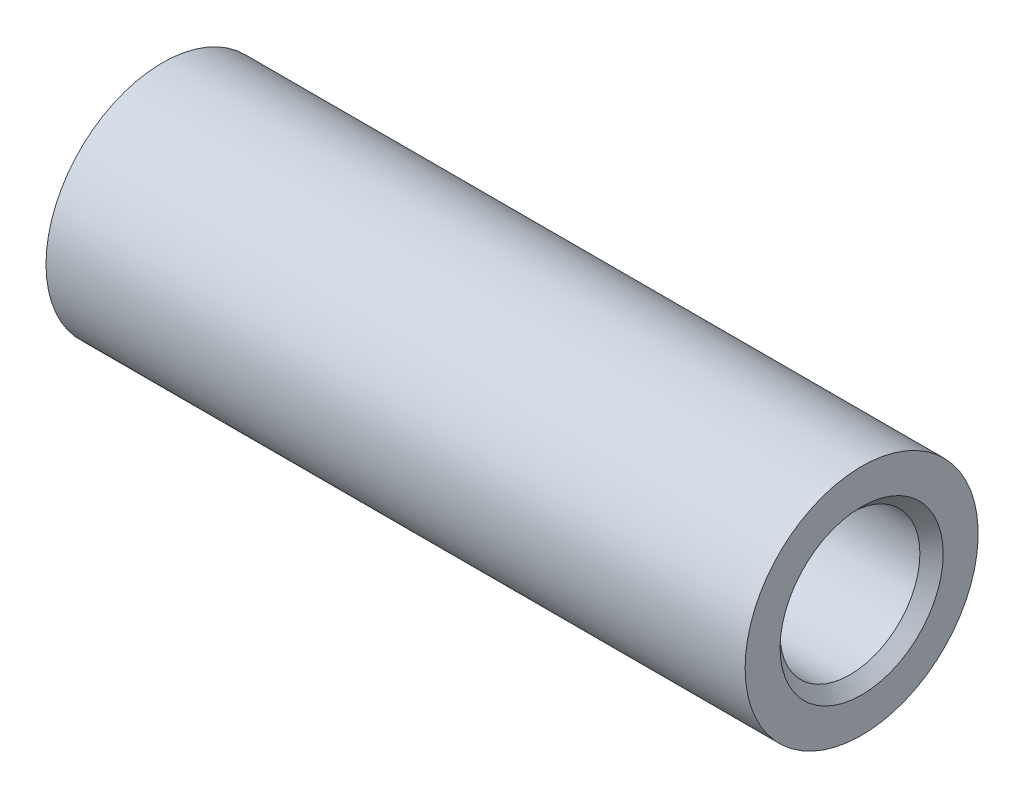
ISO-10303-21;
HEADER;
FILE_DESCRIPTION(('STEP AP214'),'2;1');
FILE_NAME('part.step','',(''),(''),'','','');
FILE_SCHEMA(('AUTOMOTIVE_DESIGN { 1 0 10303 214 1 1 1 1 }'));
ENDSEC;
DATA;
#1=APPLICATION_CONTEXT('core data for automotive mechanical design processes');
#2=APPLICATION_PROTOCOL_DEFINITION('international standard','automotive_design',2000,#1);
#3=PRODUCT_CONTEXT('',#1,'mechanical');
#4=PRODUCT('Part','Part','',(#3));
#5=PRODUCT_RELATED_PRODUCT_CATEGORY('part','',(#4));
#6=PRODUCT_DEFINITION_FORMATION('','',#4);
#7=PRODUCT_DEFINITION_CONTEXT('part definition',#1,'design');
#8=PRODUCT_DEFINITION('design','',#6,#7);
#9=PRODUCT_DEFINITION_SHAPE('','',#8);
#10=(LENGTH_UNIT() NAMED_UNIT(*) SI_UNIT(.MILLI.,.METRE.));
#11=(NAMED_UNIT(*) PLANE_ANGLE_UNIT() SI_UNIT($,.RADIAN.));
#12=(NAMED_UNIT(*) SI_UNIT($,.STERADIAN.) SOLID_ANGLE_UNIT());
#13=UNCERTAINTY_MEASURE_WITH_UNIT(LENGTH_MEASURE(1.E-05),#10,'distance_accuracy_value','');
#14=(GEOMETRIC_REPRESENTATION_CONTEXT(3) GLOBAL_UNCERTAINTY_ASSIGNED_CONTEXT((#13)) GLOBAL_UNIT_ASSIGNED_CONTEXT((#10,
#11,#12)) REPRESENTATION_CONTEXT('',''));
#15=CARTESIAN_POINT('',(0.,0.,0.));
#16=DIRECTION('',(0.,0.,1.));
#17=DIRECTION('',(1.,0.,0.));
#18=AXIS2_PLACEMENT_3D('',#15,#16,#17);
#19=CARTESIAN_POINT('',(291.421356237309,0.,0.));
#20=DIRECTION('',(-0.999999999999998,0.,0.));
#21=DIRECTION('',(0.,0.,1.));
#22=AXIS2_PLACEMENT_3D('',#19,#20,#21);
#23=CYLINDRICAL_SURFACE('',#22,50.);
#24=CARTESIAN_POINT('',(-149.999999999999,0.,0.));
#25=DIRECTION('',(0.999999999999998,0.,0.));
#26=DIRECTION('',(0.,0.,-1.));
#27=AXIS2_PLACEMENT_3D('',#24,#25,#26);
#28=CIRCLE('',#27,50.);
#29=CARTESIAN_POINT('',(-149.999999999999,0.,50.));
#30=VERTEX_POINT('',#29);
#31=EDGE_CURVE('E53',#30,#30,#28,.T.);
#32=CARTESIAN_POINT('',(149.999999999999,0.,0.));
#33=DIRECTION('',(0.999999999999998,0.,0.));
#34=DIRECTION('',(0.,0.,-1.));
#35=AXIS2_PLACEMENT_3D('',#32,#33,#34);
#36=CIRCLE('',#35,50.);
#37=CARTESIAN_POINT('',(150.,0.,50.));
#38=VERTEX_POINT('',#37);
#39=EDGE_CURVE('E52',#38,#38,#36,.T.);
#40=CARTESIAN_POINT('',(-149.999999999999,0.,50.));
#41=CARTESIAN_POINT('',(-146.874999999999,0.,50.));
#42=CARTESIAN_POINT('',(-143.749999999999,0.,50.));
#43=CARTESIAN_POINT('',(-137.5,0.,50.));
#44=CARTESIAN_POINT('',(-134.375,0.,50.));
#45=CARTESIAN_POINT('',(-128.125,0.,50.));
#46=CARTESIAN_POINT('',(-125.,0.,50.));
#47=CARTESIAN_POINT('',(-118.75,0.,50.));
#48=CARTESIAN_POINT('',(-115.625,0.,50.));
#49=CARTESIAN_POINT('',(-109.375,0.,50.));
#50=CARTESIAN_POINT('',(-106.25,0.,50.));
#51=CARTESIAN_POINT('',(-99.9999999999996,0.,50.));
#52=CARTESIAN_POINT('',(-96.8749999999997,0.,50.));
#53=CARTESIAN_POINT('',(-90.6249999999997,0.,50.));
#54=CARTESIAN_POINT('',(-87.4999999999996,0.,50.));
#55=CARTESIAN_POINT('',(-81.2499999999997,0.,50.));
#56=CARTESIAN_POINT('',(-78.1249999999997,0.,50.));
#57=CARTESIAN_POINT('',(-71.8749999999997,0.,50.));
#58=CARTESIAN_POINT('',(-68.7499999999998,0.,50.));
#59=CARTESIAN_POINT('',(-62.4999999999998,0.,50.));
#60=CARTESIAN_POINT('',(-59.3749999999998,0.,50.));
#61=CARTESIAN_POINT('',(-53.1249999999998,0.,50.));
#62=CARTESIAN_POINT('',(-49.9999999999998,0.,50.));
#63=CARTESIAN_POINT('',(-43.7499999999998,0.,50.));
#64=CARTESIAN_POINT('',(-40.6249999999999,0.,50.));
#65=CARTESIAN_POINT('',(-34.3749999999999,0.,50.));
#66=CARTESIAN_POINT('',(-31.2499999999999,0.,50.));
#67=CARTESIAN_POINT('',(-24.9999999999999,0.,50.));
#68=CARTESIAN_POINT('',(-21.8749999999999,0.,50.));
#69=CARTESIAN_POINT('',(-15.6249999999999,0.,50.));
#70=CARTESIAN_POINT('',(-12.5,0.,50.));
#71=CARTESIAN_POINT('',(-6.24999999999998,0.,50.));
#72=CARTESIAN_POINT('',(-3.12499999999999,0.,50.));
#73=CARTESIAN_POINT('',(3.12500000000001,0.,50.));
#74=CARTESIAN_POINT('',(6.25000000000001,0.,50.));
#75=CARTESIAN_POINT('',(12.5,0.,50.));
#76=CARTESIAN_POINT('',(15.625,0.,50.));
#77=CARTESIAN_POINT('',(21.875,0.,50.));
#78=CARTESIAN_POINT('',(24.9999999999999,0.,50.));
#79=CARTESIAN_POINT('',(31.2499999999999,0.,50.));
#80=CARTESIAN_POINT('',(34.3749999999999,0.,50.));
#81=CARTESIAN_POINT('',(40.6249999999999,0.,50.));
#82=CARTESIAN_POINT('',(43.7499999999999,0.,50.));
#83=CARTESIAN_POINT('',(49.9999999999999,0.,50.));
#84=CARTESIAN_POINT('',(53.1249999999998,0.,50.));
#85=CARTESIAN_POINT('',(59.3749999999998,0.,50.));
#86=CARTESIAN_POINT('',(62.4999999999998,0.,50.));
#87=CARTESIAN_POINT('',(68.7499999999998,0.,50.));
#88=CARTESIAN_POINT('',(71.8749999999998,0.,50.));
#89=CARTESIAN_POINT('',(78.1249999999998,0.,50.));
#90=CARTESIAN_POINT('',(81.2499999999998,0.,50.));
#91=CARTESIAN_POINT('',(87.4999999999997,0.,50.));
#92=CARTESIAN_POINT('',(90.6249999999997,0.,50.));
#93=CARTESIAN_POINT('',(96.8749999999997,0.,50.));
#94=CARTESIAN_POINT('',(99.9999999999997,0.,50.));
#95=CARTESIAN_POINT('',(106.25,0.,50.));
#96=CARTESIAN_POINT('',(109.375,0.,50.));
#97=CARTESIAN_POINT('',(115.625,0.,50.));
#98=CARTESIAN_POINT('',(118.75,0.,50.));
#99=CARTESIAN_POINT('',(125.,0.,50.));
#100=CARTESIAN_POINT('',(128.125,0.,50.));
#101=CARTESIAN_POINT('',(134.375,0.,50.));
#102=CARTESIAN_POINT('',(137.5,0.,50.));
#103=CARTESIAN_POINT('',(143.75,0.,50.));
#104=CARTESIAN_POINT('',(146.875,0.,50.));
#105=CARTESIAN_POINT('',(150.,0.,50.));
#106=B_SPLINE_CURVE_WITH_KNOTS('',3,(#40,#41,#42,#43,#44,#45,#46,#47,#48,#49,#50,#51,#52,#53,
#54,#55,#56,#57,#58,#59,#60,#61,#62,#63,#64,#65,#66,#67,#68,#69,#70,#71,#72,#73,#74,#75,#76,#77,
#78,#79,#80,#81,#82,#83,#84,#85,#86,#87,#88,#89,#90,#91,#92,#93,#94,#95,#96,#97,#98,#99,#100,
#101,#102,#103,#104,#105),.UNSPECIFIED.,.F.,.F.,(4,2,2,2,2,2,2,2,2,2,2,2,2,2,2,2,2,2,2,2,2,2,2,
2,2,2,2,2,2,2,2,2,4),(0.,9.37499999999997,18.7499999999999,28.1249999999999,37.4999999999999,
46.8749999999998,56.2499999999998,65.6249999999998,74.9999999999997,84.3749999999997,
93.7499999999997,103.125,112.5,121.875,131.25,140.624999999999,149.999999999999,
159.374999999999,168.749999999999,178.124999999999,187.499999999999,196.874999999999,
206.249999999999,215.624999999999,224.999999999999,234.374999999999,243.749999999999,
253.124999999999,262.499999999999,271.874999999999,281.249999999999,290.624999999999,
299.999999999999),.UNSPECIFIED.);
#107=EDGE_CURVE('BSEAM32',#30,#38,#106,.T.);
#108=ORIENTED_EDGE('',*,*,#31,.T.);
#109=ORIENTED_EDGE('',*,*,#39,.F.);
#110=ORIENTED_EDGE('',*,*,#107,.T.);
#111=ORIENTED_EDGE('',*,*,#107,.F.);
#112=EDGE_LOOP('',(#108,#110,#109,#111));
#113=FACE_BOUND('',#112,.T.);
#114=ADVANCED_FACE('F32',(#113),#23,.T.);
#115=CARTESIAN_POINT('',(-149.999999999999,0.,0.));
#116=DIRECTION('',(0.999999999999998,0.,0.));
#117=DIRECTION('',(0.,0.,-1.));
#118=AXIS2_PLACEMENT_3D('',#115,#116,#117);
#119=PLANE('',#118);
#120=CARTESIAN_POINT('',(-149.999999999999,0.,0.));
#121=DIRECTION('',(0.999999999999998,0.,0.));
#122=DIRECTION('',(0.,0.,-1.));
#123=AXIS2_PLACEMENT_3D('',#120,#121,#122);
#124=CIRCLE('',#123,35.);
#125=CARTESIAN_POINT('',(-149.999999999999,0.,35.));
#126=VERTEX_POINT('',#125);
#127=EDGE_CURVE('E47',#126,#126,#124,.T.);
#128=ORIENTED_EDGE('',*,*,#127,.T.);
#129=EDGE_LOOP('',(#128));
#130=FACE_BOUND('',#129,.T.);
#131=ORIENTED_EDGE('',*,*,#31,.F.);
#132=EDGE_LOOP('',(#131));
#133=FACE_BOUND('',#132,.T.);
#134=ADVANCED_FACE('F62',(#130,#133),#119,.F.);
#135=CARTESIAN_POINT('',(291.421356237309,0.,0.));
#136=DIRECTION('',(-0.999999999999998,0.,0.));
#137=DIRECTION('',(0.,0.,1.));
#138=AXIS2_PLACEMENT_3D('',#135,#136,#137);
#139=CYLINDRICAL_SURFACE('',#138,30.);
#140=CARTESIAN_POINT('',(-145.,0.,0.));
#141=DIRECTION('',(0.999999999999998,0.,0.));
#142=DIRECTION('',(0.,0.,-1.));
#143=AXIS2_PLACEMENT_3D('',#140,#141,#142);
#144=CIRCLE('',#143,30.);
#145=CARTESIAN_POINT('',(-144.999999999999,0.,30.));
#146=VERTEX_POINT('',#145);
#147=EDGE_CURVE('E39',#146,#146,#144,.F.);
#148=CARTESIAN_POINT('',(144.999999999999,0.,0.));
#149=DIRECTION('',(0.999999999999998,0.,0.));
#150=DIRECTION('',(0.,0.,-1.));
#151=AXIS2_PLACEMENT_3D('',#148,#149,#150);
#152=CIRCLE('',#151,30.);
#153=CARTESIAN_POINT('',(144.999999999999,0.,30.));
#154=VERTEX_POINT('',#153);
#155=EDGE_CURVE('E43',#154,#154,#152,.T.);
#156=CARTESIAN_POINT('',(-144.999999999999,0.,30.));
#157=CARTESIAN_POINT('',(-141.979166666666,0.,30.));
#158=CARTESIAN_POINT('',(-138.958333333333,0.,30.));
#159=CARTESIAN_POINT('',(-132.916666666666,0.,30.));
#160=CARTESIAN_POINT('',(-129.895833333333,0.,30.));
#161=CARTESIAN_POINT('',(-123.854166666666,0.,30.));
#162=CARTESIAN_POINT('',(-120.833333333333,0.,30.));
#163=CARTESIAN_POINT('',(-114.791666666666,0.,30.));
#164=CARTESIAN_POINT('',(-111.770833333333,0.,30.));
#165=CARTESIAN_POINT('',(-105.729166666666,0.,30.));
#166=CARTESIAN_POINT('',(-102.708333333333,0.,30.));
#167=CARTESIAN_POINT('',(-96.6666666666663,0.,30.));
#168=CARTESIAN_POINT('',(-93.645833333333,0.,30.));
#169=CARTESIAN_POINT('',(-87.6041666666664,0.,30.));
#170=CARTESIAN_POINT('',(-84.583333333333,0.,30.));
#171=CARTESIAN_POINT('',(-78.5416666666664,0.,30.));
#172=CARTESIAN_POINT('',(-75.520833333333,0.,30.));
#173=CARTESIAN_POINT('',(-69.4791666666664,0.,30.));
#174=CARTESIAN_POINT('',(-66.4583333333331,0.,30.));
#175=CARTESIAN_POINT('',(-60.4166666666665,0.,30.));
#176=CARTESIAN_POINT('',(-57.3958333333331,0.,30.));
#177=CARTESIAN_POINT('',(-51.3541666666665,0.,30.));
#178=CARTESIAN_POINT('',(-48.3333333333332,0.,30.));
#179=CARTESIAN_POINT('',(-42.2916666666665,0.,30.));
#180=CARTESIAN_POINT('',(-39.2708333333332,0.,30.));
#181=CARTESIAN_POINT('',(-33.2291666666666,0.,30.));
#182=CARTESIAN_POINT('',(-30.2083333333332,0.,30.));
#183=CARTESIAN_POINT('',(-24.1666666666666,0.,30.));
#184=CARTESIAN_POINT('',(-21.1458333333333,0.,30.));
#185=CARTESIAN_POINT('',(-15.1041666666666,0.,30.));
#186=CARTESIAN_POINT('',(-12.0833333333333,0.,30.));
#187=CARTESIAN_POINT('',(-6.04166666666661,0.,30.));
#188=CARTESIAN_POINT('',(-3.02083333333331,0.,30.));
#189=CARTESIAN_POINT('',(3.02083333333332,0.,30.));
#190=CARTESIAN_POINT('',(6.04166666666665,0.,30.));
#191=CARTESIAN_POINT('',(12.0833333333333,0.,30.));
#192=CARTESIAN_POINT('',(15.1041666666666,0.,30.));
#193=CARTESIAN_POINT('',(21.1458333333333,0.,30.));
#194=CARTESIAN_POINT('',(24.1666666666666,0.,30.));
#195=CARTESIAN_POINT('',(30.2083333333332,0.,30.));
#196=CARTESIAN_POINT('',(33.2291666666665,0.,30.));
#197=CARTESIAN_POINT('',(39.2708333333332,0.,30.));
#198=CARTESIAN_POINT('',(42.2916666666665,0.,30.));
#199=CARTESIAN_POINT('',(48.3333333333332,0.,30.));
#200=CARTESIAN_POINT('',(51.3541666666665,0.,30.));
#201=CARTESIAN_POINT('',(57.3958333333331,0.,30.));
#202=CARTESIAN_POINT('',(60.4166666666664,0.,30.));
#203=CARTESIAN_POINT('',(66.4583333333331,0.,30.));
#204=CARTESIAN_POINT('',(69.4791666666664,0.,30.));
#205=CARTESIAN_POINT('',(75.520833333333,0.,30.));
#206=CARTESIAN_POINT('',(78.5416666666664,0.,30.));
#207=CARTESIAN_POINT('',(84.583333333333,0.,30.));
#208=CARTESIAN_POINT('',(87.6041666666663,0.,30.));
#209=CARTESIAN_POINT('',(93.645833333333,0.,30.));
#210=CARTESIAN_POINT('',(96.6666666666663,0.,30.));
#211=CARTESIAN_POINT('',(102.708333333333,0.,30.));
#212=CARTESIAN_POINT('',(105.729166666666,0.,30.));
#213=CARTESIAN_POINT('',(111.770833333333,0.,30.));
#214=CARTESIAN_POINT('',(114.791666666666,0.,30.));
#215=CARTESIAN_POINT('',(120.833333333333,0.,30.));
#216=CARTESIAN_POINT('',(123.854166666666,0.,30.));
#217=CARTESIAN_POINT('',(129.895833333333,0.,30.));
#218=CARTESIAN_POINT('',(132.916666666666,0.,30.));
#219=CARTESIAN_POINT('',(138.958333333333,0.,30.));
#220=CARTESIAN_POINT('',(141.979166666666,0.,30.));
#221=CARTESIAN_POINT('',(144.999999999999,0.,30.));
#222=B_SPLINE_CURVE_WITH_KNOTS('',3,(#156,#157,#158,#159,#160,#161,#162,#163,#164,#165,#166,
#167,#168,#169,#170,#171,#172,#173,#174,#175,#176,#177,#178,#179,#180,#181,#182,#183,#184,#185,
#186,#187,#188,#189,#190,#191,#192,#193,#194,#195,#196,#197,#198,#199,#200,#201,#202,#203,#204,
#205,#206,#207,#208,#209,#210,#211,#212,#213,#214,#215,#216,#217,#218,#219,#220,#221),
.UNSPECIFIED.,.F.,.F.,(4,2,2,2,2,2,2,2,2,2,2,2,2,2,2,2,2,2,2,2,2,2,2,2,2,2,2,2,2,2,2,2,4),(0.,
9.06249999999992,18.1249999999999,27.1874999999999,36.2499999999998,45.3124999999998,
54.3749999999998,63.4374999999998,72.4999999999997,81.5624999999997,90.6249999999996,
99.6874999999996,108.75,117.8125,126.875,135.9375,144.999999999999,154.062499999999,
163.124999999999,172.187499999999,181.249999999999,190.312499999999,199.374999999999,
208.437499999999,217.499999999999,226.562499999999,235.624999999999,244.687499999999,
253.749999999999,262.812499999999,271.874999999999,280.937499999999,289.999999999999),.UNSPECIFIED.);
#223=EDGE_CURVE('BSEAM68',#146,#154,#222,.T.);
#224=ORIENTED_EDGE('',*,*,#147,.T.);
#225=ORIENTED_EDGE('',*,*,#155,.T.);
#226=ORIENTED_EDGE('',*,*,#223,.T.);
#227=ORIENTED_EDGE('',*,*,#223,.F.);
#228=EDGE_LOOP('',(#224,#226,#225,#227));
#229=FACE_BOUND('',#228,.T.);
#230=ADVANCED_FACE('F68',(#229),#139,.F.);
#231=CARTESIAN_POINT('',(149.999999999999,0.,0.));
#232=DIRECTION('',(0.999999999999998,0.,0.));
#233=DIRECTION('',(0.,0.,-1.));
#234=AXIS2_PLACEMENT_3D('',#231,#232,#233);
#235=PLANE('',#234);
#236=CARTESIAN_POINT('',(149.999999999999,0.,0.));
#237=DIRECTION('',(0.999999999999998,0.,0.));
#238=DIRECTION('',(0.,0.,-1.));
#239=AXIS2_PLACEMENT_3D('',#236,#237,#238);
#240=CIRCLE('',#239,35.);
#241=CARTESIAN_POINT('',(149.999999999999,0.,-35.));
#242=VERTEX_POINT('',#241);
#243=EDGE_CURVE('E10',#242,#242,#240,.F.);
#244=ORIENTED_EDGE('',*,*,#243,.T.);
#245=EDGE_LOOP('',(#244));
#246=FACE_BOUND('',#245,.T.);
#247=ORIENTED_EDGE('',*,*,#39,.T.);
#248=EDGE_LOOP('',(#247));
#249=FACE_BOUND('',#248,.T.);
#250=ADVANCED_FACE('F59',(#246,#249),#235,.T.);
#251=CARTESIAN_POINT('',(-150.,0.,0.));
#252=DIRECTION('',(-0.999999999999998,0.,0.));
#253=DIRECTION('',(0.,0.,1.));
#254=AXIS2_PLACEMENT_3D('',#251,#252,#253);
#255=CONICAL_SURFACE('',#254,35.,0.785398163397451);
#256=CARTESIAN_POINT('',(-145.,0.,30.));
#257=CARTESIAN_POINT('',(-145.052083333333,0.,30.0520833333333));
#258=CARTESIAN_POINT('',(-145.104166666666,0.,30.1041666666666));
#259=CARTESIAN_POINT('',(-145.208333333333,0.,30.2083333333333));
#260=CARTESIAN_POINT('',(-145.260416666666,0.,30.2604166666666));
#261=CARTESIAN_POINT('',(-145.364583333333,0.,30.3645833333333));
#262=CARTESIAN_POINT('',(-145.416666666666,0.,30.4166666666666));
#263=CARTESIAN_POINT('',(-145.520833333333,0.,30.5208333333333));
#264=CARTESIAN_POINT('',(-145.572916666666,0.,30.5729166666666));
#265=CARTESIAN_POINT('',(-145.677083333333,0.,30.6770833333333));
#266=CARTESIAN_POINT('',(-145.729166666666,0.,30.7291666666666));
#267=CARTESIAN_POINT('',(-145.833333333333,0.,30.8333333333333));
#268=CARTESIAN_POINT('',(-145.885416666666,0.,30.8854166666666));
#269=CARTESIAN_POINT('',(-145.989583333333,0.,30.9895833333333));
#270=CARTESIAN_POINT('',(-146.041666666666,0.,31.0416666666666));
#271=CARTESIAN_POINT('',(-146.145833333333,0.,31.1458333333333));
#272=CARTESIAN_POINT('',(-146.197916666666,0.,31.1979166666666));
#273=CARTESIAN_POINT('',(-146.302083333333,0.,31.3020833333333));
#274=CARTESIAN_POINT('',(-146.354166666666,0.,31.3541666666666));
#275=CARTESIAN_POINT('',(-146.458333333333,0.,31.4583333333333));
#276=CARTESIAN_POINT('',(-146.510416666666,0.,31.5104166666666));
#277=CARTESIAN_POINT('',(-146.614583333333,0.,31.6145833333333));
#278=CARTESIAN_POINT('',(-146.666666666666,0.,31.6666666666666));
#279=CARTESIAN_POINT('',(-146.770833333333,0.,31.7708333333333));
#280=CARTESIAN_POINT('',(-146.822916666666,0.,31.8229166666666));
#281=CARTESIAN_POINT('',(-146.927083333333,0.,31.9270833333333));
#282=CARTESIAN_POINT('',(-146.979166666666,0.,31.9791666666666));
#283=CARTESIAN_POINT('',(-147.083333333333,0.,32.0833333333333));
#284=CARTESIAN_POINT('',(-147.135416666666,0.,32.1354166666666));
#285=CARTESIAN_POINT('',(-147.239583333333,0.,32.2395833333333));
#286=CARTESIAN_POINT('',(-147.291666666666,0.,32.2916666666666));
#287=CARTESIAN_POINT('',(-147.395833333333,0.,32.3958333333333));
#288=CARTESIAN_POINT('',(-147.447916666666,0.,32.4479166666666));
#289=CARTESIAN_POINT('',(-147.552083333333,0.,32.5520833333333));
#290=CARTESIAN_POINT('',(-147.604166666666,0.,32.6041666666666));
#291=CARTESIAN_POINT('',(-147.708333333333,0.,32.7083333333333));
#292=CARTESIAN_POINT('',(-147.760416666666,0.,32.7604166666666));
#293=CARTESIAN_POINT('',(-147.864583333333,0.,32.8645833333333));
#294=CARTESIAN_POINT('',(-147.916666666666,0.,32.9166666666666));
#295=CARTESIAN_POINT('',(-148.020833333333,0.,33.0208333333333));
#296=CARTESIAN_POINT('',(-148.072916666666,0.,33.0729166666666));
#297=CARTESIAN_POINT('',(-148.177083333333,0.,33.1770833333333));
#298=CARTESIAN_POINT('',(-148.229166666666,0.,33.2291666666666));
#299=CARTESIAN_POINT('',(-148.333333333333,0.,33.3333333333333));
#300=CARTESIAN_POINT('',(-148.385416666666,0.,33.3854166666666));
#301=CARTESIAN_POINT('',(-148.489583333333,0.,33.4895833333333));
#302=CARTESIAN_POINT('',(-148.541666666666,0.,33.5416666666666));
#303=CARTESIAN_POINT('',(-148.645833333333,0.,33.6458333333333));
#304=CARTESIAN_POINT('',(-148.697916666666,0.,33.6979166666666));
#305=CARTESIAN_POINT('',(-148.802083333333,0.,33.8020833333333));
#306=CARTESIAN_POINT('',(-148.854166666666,0.,33.8541666666666));
#307=CARTESIAN_POINT('',(-148.958333333333,0.,33.9583333333333));
#308=CARTESIAN_POINT('',(-149.010416666666,0.,34.0104166666666));
#309=CARTESIAN_POINT('',(-149.114583333333,0.,34.1145833333333));
#310=CARTESIAN_POINT('',(-149.166666666666,0.,34.1666666666666));
#311=CARTESIAN_POINT('',(-149.270833333333,0.,34.2708333333333));
#312=CARTESIAN_POINT('',(-149.322916666666,0.,34.3229166666666));
#313=CARTESIAN_POINT('',(-149.427083333333,0.,34.4270833333333));
#314=CARTESIAN_POINT('',(-149.479166666666,0.,34.4791666666666));
#315=CARTESIAN_POINT('',(-149.583333333333,0.,34.5833333333333));
#316=CARTESIAN_POINT('',(-149.635416666666,0.,34.6354166666666));
#317=CARTESIAN_POINT('',(-149.739583333333,0.,34.7395833333333));
#318=CARTESIAN_POINT('',(-149.791666666666,0.,34.7916666666666));
#319=CARTESIAN_POINT('',(-149.895833333333,0.,34.8958333333333));
#320=CARTESIAN_POINT('',(-149.947916666666,0.,34.9479166666667));
#321=CARTESIAN_POINT('',(-149.999999999999,0.,35.));
#322=B_SPLINE_CURVE_WITH_KNOTS('',3,(#256,#257,#258,#259,#260,#261,#262,#263,#264,#265,#266,
#267,#268,#269,#270,#271,#272,#273,#274,#275,#276,#277,#278,#279,#280,#281,#282,#283,#284,#285,
#286,#287,#288,#289,#290,#291,#292,#293,#294,#295,#296,#297,#298,#299,#300,#301,#302,#303,#304,
#305,#306,#307,#308,#309,#310,#311,#312,#313,#314,#315,#316,#317,#318,#319,#320,#321),
.UNSPECIFIED.,.F.,.F.,(4,2,2,2,2,2,2,2,2,2,2,2,2,2,2,2,2,2,2,2,2,2,2,2,2,2,2,2,2,2,2,2,4),(0.,
0.220970869120794,0.441941738241588,0.662912607362382,0.883883476483178,1.10485434560397,
1.32582521472477,1.54679608384556,1.76776695296635,1.98873782208714,2.20970869120794,
2.43067956032875,2.65165042944955,2.87262129857034,3.09359216769113,3.31456303681193,
3.53553390593272,3.75650477505352,3.97747564417431,4.1984465132951,4.41941738241589,
4.64038825153669,4.8613591206575,5.0823299897783,5.30330085889909,5.52427172801989,
5.74524259714068,5.96621346626147,6.18718433538227,6.40815520450306,6.62912607362386,
6.85009694274465,7.07106781186546),.UNSPECIFIED.);
#323=EDGE_CURVE('BSEAM72',#146,#126,#322,.T.);
#324=ORIENTED_EDGE('',*,*,#147,.F.);
#325=ORIENTED_EDGE('',*,*,#127,.F.);
#326=ORIENTED_EDGE('',*,*,#323,.T.);
#327=ORIENTED_EDGE('',*,*,#323,.F.);
#328=EDGE_LOOP('',(#324,#326,#325,#327));
#329=FACE_BOUND('',#328,.T.);
#330=ADVANCED_FACE('F72',(#329),#255,.F.);
#331=CARTESIAN_POINT('',(144.999999999999,0.,0.));
#332=DIRECTION('',(0.999999999999998,0.,0.));
#333=DIRECTION('',(0.,0.,-1.));
#334=AXIS2_PLACEMENT_3D('',#331,#332,#333);
#335=CONICAL_SURFACE('',#334,30.,0.785398163397448);
#336=ORIENTED_EDGE('',*,*,#243,.F.);
#337=EDGE_LOOP('',(#336));
#338=FACE_BOUND('',#337,.T.);
#339=ORIENTED_EDGE('',*,*,#155,.F.);
#340=EDGE_LOOP('',(#339));
#341=FACE_BOUND('',#340,.T.);
#342=ADVANCED_FACE('F34',(#338,#341),#335,.F.);
#343=CLOSED_SHELL('',(#114,#134,#230,#250,#330,#342));
#344=MANIFOLD_SOLID_BREP('B2',#343);
#345=ADVANCED_BREP_SHAPE_REPRESENTATION('',(#18,#344),#14);
#346=SHAPE_DEFINITION_REPRESENTATION(#9,#345);
ENDSEC;
END-ISO-10303-21;
